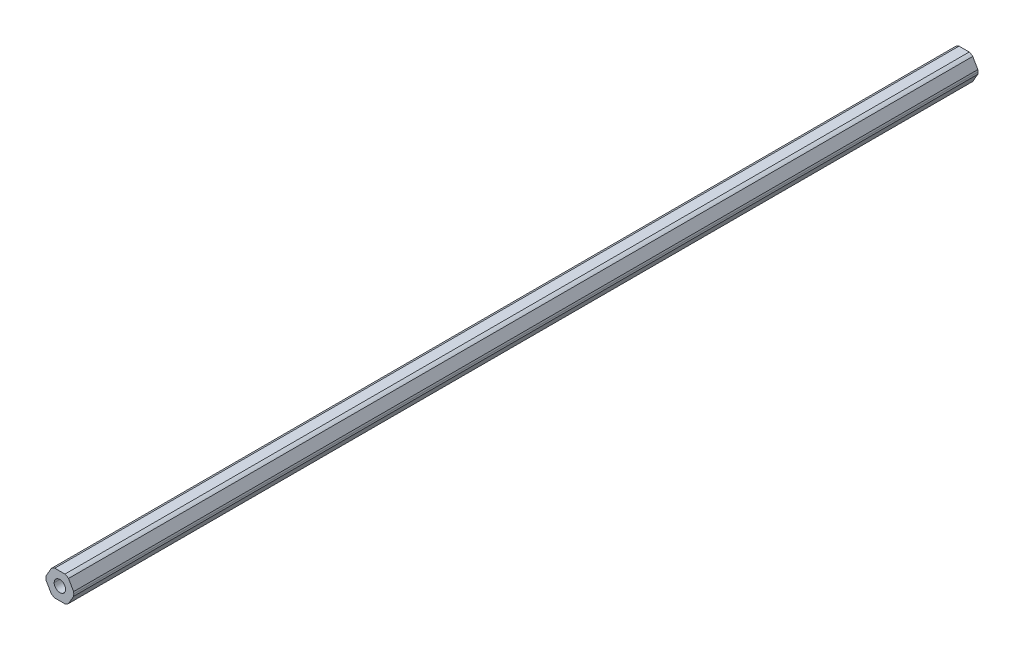
ISO-10303-21;
HEADER;
FILE_DESCRIPTION(('STEP AP214'),'2;1');
FILE_NAME('part.step','',(''),(''),'','','');
FILE_SCHEMA(('AUTOMOTIVE_DESIGN { 1 0 10303 214 1 1 1 1 }'));
ENDSEC;
DATA;
#1=APPLICATION_CONTEXT('core data for automotive mechanical design processes');
#2=APPLICATION_PROTOCOL_DEFINITION('international standard','automotive_design',2000,#1);
#3=PRODUCT_CONTEXT('',#1,'mechanical');
#4=PRODUCT('Part','Part','',(#3));
#5=PRODUCT_RELATED_PRODUCT_CATEGORY('part','',(#4));
#6=PRODUCT_DEFINITION_FORMATION('','',#4);
#7=PRODUCT_DEFINITION_CONTEXT('part definition',#1,'design');
#8=PRODUCT_DEFINITION('design','',#6,#7);
#9=PRODUCT_DEFINITION_SHAPE('','',#8);
#10=(LENGTH_UNIT() NAMED_UNIT(*) SI_UNIT(.MILLI.,.METRE.));
#11=(NAMED_UNIT(*) PLANE_ANGLE_UNIT() SI_UNIT($,.RADIAN.));
#12=(NAMED_UNIT(*) SI_UNIT($,.STERADIAN.) SOLID_ANGLE_UNIT());
#13=UNCERTAINTY_MEASURE_WITH_UNIT(LENGTH_MEASURE(1.E-05),#10,'distance_accuracy_value','');
#14=(GEOMETRIC_REPRESENTATION_CONTEXT(3) GLOBAL_UNCERTAINTY_ASSIGNED_CONTEXT((#13)) GLOBAL_UNIT_ASSIGNED_CONTEXT((#10,
#11,#12)) REPRESENTATION_CONTEXT('',''));
#15=CARTESIAN_POINT('',(0.,0.,0.));
#16=DIRECTION('',(0.,0.,1.));
#17=DIRECTION('',(1.,0.,0.));
#18=AXIS2_PLACEMENT_3D('',#15,#16,#17);
#19=CARTESIAN_POINT('',(0.,0.,-457.2));
#20=DIRECTION('',(0.,0.,1.));
#21=DIRECTION('',(1.,0.,0.));
#22=AXIS2_PLACEMENT_3D('',#19,#20,#21);
#23=CYLINDRICAL_SURFACE('',#22,2.1);
#24=CARTESIAN_POINT('',(0.,0.,-123.825));
#25=DIRECTION('',(0.,0.,1.));
#26=DIRECTION('',(1.,0.,0.));
#27=AXIS2_PLACEMENT_3D('',#24,#25,#26);
#28=CIRCLE('',#27,2.1);
#29=CARTESIAN_POINT('',(2.1,0.,-123.825));
#30=VERTEX_POINT('',#29);
#31=CARTESIAN_POINT('',(-2.1,0.,-123.825));
#32=VERTEX_POINT('',#31);
#33=EDGE_CURVE('E65',#30,#32,#28,.F.);
#34=ORIENTED_EDGE('',*,*,#33,.F.);
#35=DIRECTION('',(0.,0.,1.));
#36=VECTOR('',#35,1.);
#37=CARTESIAN_POINT('',(2.1,0.,-457.2));
#38=LINE('',#37,#36);
#39=CARTESIAN_POINT('',(2.1,0.,-457.2));
#40=VERTEX_POINT('',#39);
#41=EDGE_CURVE('E211',#40,#30,#38,.T.);
#42=ORIENTED_EDGE('',*,*,#41,.F.);
#43=CARTESIAN_POINT('',(0.,0.,-457.2));
#44=DIRECTION('',(0.,0.,1.));
#45=DIRECTION('',(1.,0.,0.));
#46=AXIS2_PLACEMENT_3D('',#43,#44,#45);
#47=CIRCLE('',#46,2.1);
#48=CARTESIAN_POINT('',(-2.1,0.,-457.2));
#49=VERTEX_POINT('',#48);
#50=EDGE_CURVE('E191',#49,#40,#47,.T.);
#51=ORIENTED_EDGE('',*,*,#50,.F.);
#52=DIRECTION('',(0.,0.,1.));
#53=VECTOR('',#52,1.);
#54=CARTESIAN_POINT('',(-2.1,0.,-457.2));
#55=LINE('',#54,#53);
#56=EDGE_CURVE('E52',#49,#32,#55,.T.);
#57=ORIENTED_EDGE('',*,*,#56,.T.);
#58=EDGE_LOOP('',(#34,#42,#51,#57));
#59=FACE_BOUND('',#58,.T.);
#60=ADVANCED_FACE('F44',(#59),#23,.F.);
#61=CARTESIAN_POINT('',(0.,0.,-457.2));
#62=DIRECTION('',(0.,0.,1.));
#63=DIRECTION('',(1.,0.,0.));
#64=AXIS2_PLACEMENT_3D('',#61,#62,#63);
#65=CYLINDRICAL_SURFACE('',#64,5.12);
#66=DIRECTION('',(0.,0.,1.));
#67=VECTOR('',#66,1.);
#68=CARTESIAN_POINT('',(5.12,0.,-457.2));
#69=LINE('',#68,#67);
#70=CARTESIAN_POINT('',(5.12,0.,-457.2));
#71=VERTEX_POINT('',#70);
#72=CARTESIAN_POINT('',(5.12,0.,-123.825));
#73=VERTEX_POINT('',#72);
#74=EDGE_CURVE('E227',#71,#73,#69,.T.);
#75=ORIENTED_EDGE('',*,*,#74,.T.);
#76=CARTESIAN_POINT('',(0.,0.,-123.825));
#77=DIRECTION('',(0.,0.,1.));
#78=DIRECTION('',(1.,0.,0.));
#79=AXIS2_PLACEMENT_3D('',#76,#77,#78);
#80=CIRCLE('',#79,5.12);
#81=CARTESIAN_POINT('',(5.06425896558911,-0.753446168913433,-123.825));
#82=VERTEX_POINT('',#81);
#83=EDGE_CURVE('E166',#82,#73,#80,.T.);
#84=ORIENTED_EDGE('',*,*,#83,.F.);
#85=DIRECTION('',(0.,0.,-1.));
#86=VECTOR('',#85,1.);
#87=CARTESIAN_POINT('',(5.06425896558911,-0.753446168913433,-457.2));
#88=LINE('',#87,#86);
#89=CARTESIAN_POINT('',(5.06425896558911,-0.753446168913433,-457.2));
#90=VERTEX_POINT('',#89);
#91=EDGE_CURVE('E230',#82,#90,#88,.T.);
#92=ORIENTED_EDGE('',*,*,#91,.T.);
#93=CARTESIAN_POINT('',(0.,0.,-457.2));
#94=DIRECTION('',(0.,0.,1.));
#95=DIRECTION('',(1.,0.,0.));
#96=AXIS2_PLACEMENT_3D('',#93,#94,#95);
#97=CIRCLE('',#96,5.12);
#98=EDGE_CURVE('E229',#90,#71,#97,.T.);
#99=ORIENTED_EDGE('',*,*,#98,.T.);
#100=EDGE_LOOP('',(#75,#84,#92,#99));
#101=FACE_BOUND('',#100,.T.);
#102=ADVANCED_FACE('F354',(#101),#65,.T.);
#103=CARTESIAN_POINT('',(2.74963065701564,-4.7625,457.2));
#104=DIRECTION('',(-0.866025403784442,0.5,0.));
#105=DIRECTION('',(0.,0.,1.));
#106=AXIS2_PLACEMENT_3D('',#103,#104,#105);
#107=PLANE('',#106);
#108=DIRECTION('',(0.499999999999991,0.866025403784444,0.));
#109=VECTOR('',#108,1.);
#110=CARTESIAN_POINT('',(3.18463300545771,-4.00905383108654,-123.825));
#111=LINE('',#110,#109);
#112=CARTESIAN_POINT('',(3.18463300545771,-4.00905383108654,-123.825));
#113=VERTEX_POINT('',#112);
#114=EDGE_CURVE('E313',#113,#82,#111,.T.);
#115=ORIENTED_EDGE('',*,*,#114,.F.);
#116=DIRECTION('',(0.,0.,1.));
#117=VECTOR('',#116,1.);
#118=CARTESIAN_POINT('',(3.1846330054577,-4.00905383108652,-457.2));
#119=LINE('',#118,#117);
#120=CARTESIAN_POINT('',(3.1846330054577,-4.00905383108652,-457.2));
#121=VERTEX_POINT('',#120);
#122=EDGE_CURVE('E185',#121,#113,#119,.T.);
#123=ORIENTED_EDGE('',*,*,#122,.F.);
#124=DIRECTION('',(0.5,0.866025403784442,0.));
#125=VECTOR('',#124,1.);
#126=CARTESIAN_POINT('',(2.74963065701564,-4.7625,-457.2));
#127=LINE('',#126,#125);
#128=EDGE_CURVE('E240',#121,#90,#127,.T.);
#129=ORIENTED_EDGE('',*,*,#128,.T.);
#130=ORIENTED_EDGE('',*,*,#91,.F.);
#131=EDGE_LOOP('',(#115,#123,#129,#130));
#132=FACE_BOUND('',#131,.T.);
#133=ADVANCED_FACE('F351',(#132),#107,.F.);
#134=CARTESIAN_POINT('',(5.49926131403117,0.,457.2));
#135=DIRECTION('',(-0.866025403784438,-0.5,0.));
#136=DIRECTION('',(-0.5,0.866025403784438,0.));
#137=AXIS2_PLACEMENT_3D('',#134,#135,#136);
#138=PLANE('',#137);
#139=DIRECTION('',(-0.500000000000001,0.866025403784438,0.));
#140=VECTOR('',#139,1.);
#141=CARTESIAN_POINT('',(5.06425896558911,0.753446168913416,-123.825));
#142=LINE('',#141,#140);
#143=CARTESIAN_POINT('',(5.06425896558911,0.753446168913416,-123.825));
#144=VERTEX_POINT('',#143);
#145=CARTESIAN_POINT('',(3.18463300545762,4.00905383108658,-123.825));
#146=VERTEX_POINT('',#145);
#147=EDGE_CURVE('E59',#144,#146,#142,.T.);
#148=ORIENTED_EDGE('',*,*,#147,.F.);
#149=DIRECTION('',(0.,0.,1.));
#150=VECTOR('',#149,1.);
#151=CARTESIAN_POINT('',(5.06425896558911,0.753446168913412,-457.2));
#152=LINE('',#151,#150);
#153=CARTESIAN_POINT('',(5.06425896558911,0.753446168913416,-457.2));
#154=VERTEX_POINT('',#153);
#155=EDGE_CURVE('E175',#154,#144,#152,.T.);
#156=ORIENTED_EDGE('',*,*,#155,.F.);
#157=DIRECTION('',(-0.5,0.866025403784438,0.));
#158=VECTOR('',#157,1.);
#159=CARTESIAN_POINT('',(5.49926131403117,0.,-457.2));
#160=LINE('',#159,#158);
#161=CARTESIAN_POINT('',(3.18463300545762,4.00905383108658,-457.2));
#162=VERTEX_POINT('',#161);
#163=EDGE_CURVE('E221',#154,#162,#160,.T.);
#164=ORIENTED_EDGE('',*,*,#163,.T.);
#165=DIRECTION('',(0.,0.,-1.));
#166=VECTOR('',#165,1.);
#167=CARTESIAN_POINT('',(3.18463300545762,4.00905383108658,-457.2));
#168=LINE('',#167,#166);
#169=EDGE_CURVE('E177',#146,#162,#168,.T.);
#170=ORIENTED_EDGE('',*,*,#169,.F.);
#171=EDGE_LOOP('',(#148,#156,#164,#170));
#172=FACE_BOUND('',#171,.T.);
#173=ADVANCED_FACE('F173',(#172),#138,.F.);
#174=CARTESIAN_POINT('',(2.74963065701557,4.7625,457.2));
#175=DIRECTION('',(0.,-1.,0.));
#176=DIRECTION('',(0.,0.,-1.));
#177=AXIS2_PLACEMENT_3D('',#174,#175,#176);
#178=PLANE('',#177);
#179=DIRECTION('',(-1.,0.,0.));
#180=VECTOR('',#179,1.);
#181=CARTESIAN_POINT('',(1.87962596013146,4.76249999999999,-123.825));
#182=LINE('',#181,#180);
#183=CARTESIAN_POINT('',(1.87962596013146,4.76249999999999,-123.825));
#184=VERTEX_POINT('',#183);
#185=CARTESIAN_POINT('',(-1.8796259601315,4.7625,-123.825));
#186=VERTEX_POINT('',#185);
#187=EDGE_CURVE('E328',#184,#186,#182,.T.);
#188=ORIENTED_EDGE('',*,*,#187,.F.);
#189=DIRECTION('',(0.,0.,1.));
#190=VECTOR('',#189,1.);
#191=CARTESIAN_POINT('',(1.87962596013147,4.7625,-457.2));
#192=LINE('',#191,#190);
#193=CARTESIAN_POINT('',(1.87962596013147,4.7625,-457.2));
#194=VERTEX_POINT('',#193);
#195=EDGE_CURVE('E202',#194,#184,#192,.T.);
#196=ORIENTED_EDGE('',*,*,#195,.F.);
#197=DIRECTION('',(-1.,0.,0.));
#198=VECTOR('',#197,1.);
#199=CARTESIAN_POINT('',(2.74963065701557,4.7625,-457.2));
#200=LINE('',#199,#198);
#201=CARTESIAN_POINT('',(-1.8796259601315,4.7625,-457.2));
#202=VERTEX_POINT('',#201);
#203=EDGE_CURVE('E255',#194,#202,#200,.T.);
#204=ORIENTED_EDGE('',*,*,#203,.T.);
#205=DIRECTION('',(0.,0.,-1.));
#206=VECTOR('',#205,1.);
#207=CARTESIAN_POINT('',(-1.8796259601315,4.7625,-457.2));
#208=LINE('',#207,#206);
#209=EDGE_CURVE('E249',#186,#202,#208,.T.);
#210=ORIENTED_EDGE('',*,*,#209,.F.);
#211=EDGE_LOOP('',(#188,#196,#204,#210));
#212=FACE_BOUND('',#211,.T.);
#213=ADVANCED_FACE('F334',(#212),#178,.F.);
#214=CARTESIAN_POINT('',(-2.7496306570156,4.7625,457.2));
#215=DIRECTION('',(0.866025403784442,-0.5,0.));
#216=DIRECTION('',(0.,0.,-1.));
#217=AXIS2_PLACEMENT_3D('',#214,#215,#216);
#218=PLANE('',#217);
#219=DIRECTION('',(-0.499999999999993,-0.866025403784443,0.));
#220=VECTOR('',#219,1.);
#221=CARTESIAN_POINT('',(-3.18463300545766,4.00905383108656,-123.825));
#222=LINE('',#221,#220);
#223=CARTESIAN_POINT('',(-3.18463300545767,4.00905383108657,-123.825));
#224=VERTEX_POINT('',#223);
#225=CARTESIAN_POINT('',(-5.06425896558912,0.753446168913382,-123.825));
#226=VERTEX_POINT('',#225);
#227=EDGE_CURVE('E324',#224,#226,#222,.T.);
#228=ORIENTED_EDGE('',*,*,#227,.F.);
#229=DIRECTION('',(0.,0.,1.));
#230=VECTOR('',#229,1.);
#231=CARTESIAN_POINT('',(-3.18463300545766,4.00905383108655,-457.2));
#232=LINE('',#231,#230);
#233=CARTESIAN_POINT('',(-3.18463300545766,4.00905383108655,-457.2));
#234=VERTEX_POINT('',#233);
#235=EDGE_CURVE('E208',#234,#224,#232,.T.);
#236=ORIENTED_EDGE('',*,*,#235,.F.);
#237=DIRECTION('',(-0.5,-0.866025403784442,0.));
#238=VECTOR('',#237,1.);
#239=CARTESIAN_POINT('',(-2.7496306570156,4.7625,-457.2));
#240=LINE('',#239,#238);
#241=CARTESIAN_POINT('',(-5.06425896558912,0.753446168913382,-457.2));
#242=VERTEX_POINT('',#241);
#243=EDGE_CURVE('E252',#234,#242,#240,.T.);
#244=ORIENTED_EDGE('',*,*,#243,.T.);
#245=DIRECTION('',(0.,0.,-1.));
#246=VECTOR('',#245,1.);
#247=CARTESIAN_POINT('',(-5.06425896558912,0.753446168913382,-457.2));
#248=LINE('',#247,#246);
#249=EDGE_CURVE('E239',#226,#242,#248,.T.);
#250=ORIENTED_EDGE('',*,*,#249,.F.);
#251=EDGE_LOOP('',(#228,#236,#244,#250));
#252=FACE_BOUND('',#251,.T.);
#253=ADVANCED_FACE('F267',(#252),#218,.F.);
#254=CARTESIAN_POINT('',(-5.49926131403117,0.,457.2));
#255=DIRECTION('',(0.866025403784435,0.500000000000007,0.));
#256=DIRECTION('',(0.,0.,-1.));
#257=AXIS2_PLACEMENT_3D('',#254,#255,#256);
#258=PLANE('',#257);
#259=DIRECTION('',(0.500000000000007,-0.866025403784435,0.));
#260=VECTOR('',#259,1.);
#261=CARTESIAN_POINT('',(-5.06425896558911,-0.753446168913448,-123.825));
#262=LINE('',#261,#260);
#263=CARTESIAN_POINT('',(-5.06425896558911,-0.753446168913446,-123.825));
#264=VERTEX_POINT('',#263);
#265=CARTESIAN_POINT('',(-3.1846330054576,-4.0090538310866,-123.825));
#266=VERTEX_POINT('',#265);
#267=EDGE_CURVE('E321',#264,#266,#262,.T.);
#268=ORIENTED_EDGE('',*,*,#267,.F.);
#269=DIRECTION('',(0.,0.,1.));
#270=VECTOR('',#269,1.);
#271=CARTESIAN_POINT('',(-5.06425896558911,-0.75344616891345,-457.2));
#272=LINE('',#271,#270);
#273=CARTESIAN_POINT('',(-5.06425896558911,-0.75344616891345,-457.2));
#274=VERTEX_POINT('',#273);
#275=EDGE_CURVE('E247',#274,#264,#272,.T.);
#276=ORIENTED_EDGE('',*,*,#275,.F.);
#277=DIRECTION('',(0.500000000000007,-0.866025403784435,0.));
#278=VECTOR('',#277,1.);
#279=CARTESIAN_POINT('',(-5.49926131403117,0.,-457.2));
#280=LINE('',#279,#278);
#281=CARTESIAN_POINT('',(-3.1846330054576,-4.0090538310866,-457.2));
#282=VERTEX_POINT('',#281);
#283=EDGE_CURVE('E256',#274,#282,#280,.T.);
#284=ORIENTED_EDGE('',*,*,#283,.T.);
#285=DIRECTION('',(0.,0.,-1.));
#286=VECTOR('',#285,1.);
#287=CARTESIAN_POINT('',(-3.1846330054576,-4.0090538310866,-457.2));
#288=LINE('',#287,#286);
#289=EDGE_CURVE('E223',#266,#282,#288,.T.);
#290=ORIENTED_EDGE('',*,*,#289,.F.);
#291=EDGE_LOOP('',(#268,#276,#284,#290));
#292=FACE_BOUND('',#291,.T.);
#293=ADVANCED_FACE('F340',(#292),#258,.F.);
#294=CARTESIAN_POINT('',(-2.74963065701554,-4.7625,457.2));
#295=DIRECTION('',(0.,1.,0.));
#296=DIRECTION('',(1.,0.,0.));
#297=AXIS2_PLACEMENT_3D('',#294,#295,#296);
#298=PLANE('',#297);
#299=DIRECTION('',(1.,0.,0.));
#300=VECTOR('',#299,1.);
#301=CARTESIAN_POINT('',(-1.87962596013144,-4.7625,-123.825));
#302=LINE('',#301,#300);
#303=CARTESIAN_POINT('',(-1.87962596013144,-4.7625,-123.825));
#304=VERTEX_POINT('',#303);
#305=CARTESIAN_POINT('',(1.87962596013154,-4.7625,-123.825));
#306=VERTEX_POINT('',#305);
#307=EDGE_CURVE('E317',#304,#306,#302,.T.);
#308=ORIENTED_EDGE('',*,*,#307,.F.);
#309=DIRECTION('',(0.,0.,1.));
#310=VECTOR('',#309,1.);
#311=CARTESIAN_POINT('',(-1.87962596013144,-4.7625,-457.2));
#312=LINE('',#311,#310);
#313=CARTESIAN_POINT('',(-1.87962596013144,-4.7625,-457.2));
#314=VERTEX_POINT('',#313);
#315=EDGE_CURVE('E235',#314,#304,#312,.T.);
#316=ORIENTED_EDGE('',*,*,#315,.F.);
#317=DIRECTION('',(1.,0.,0.));
#318=VECTOR('',#317,1.);
#319=CARTESIAN_POINT('',(-2.74963065701554,-4.7625,-457.2));
#320=LINE('',#319,#318);
#321=CARTESIAN_POINT('',(1.87962596013154,-4.7625,-457.2));
#322=VERTEX_POINT('',#321);
#323=EDGE_CURVE('E280',#314,#322,#320,.T.);
#324=ORIENTED_EDGE('',*,*,#323,.T.);
#325=DIRECTION('',(0.,0.,-1.));
#326=VECTOR('',#325,1.);
#327=CARTESIAN_POINT('',(1.87962596013154,-4.7625,-457.2));
#328=LINE('',#327,#326);
#329=EDGE_CURVE('E195',#306,#322,#328,.T.);
#330=ORIENTED_EDGE('',*,*,#329,.F.);
#331=EDGE_LOOP('',(#308,#316,#324,#330));
#332=FACE_BOUND('',#331,.T.);
#333=ADVANCED_FACE('F345',(#332),#298,.F.);
#334=CARTESIAN_POINT('',(0.,0.,-457.2));
#335=DIRECTION('',(0.,0.,1.));
#336=DIRECTION('',(1.,0.,0.));
#337=AXIS2_PLACEMENT_3D('',#334,#335,#336);
#338=CYLINDRICAL_SURFACE('',#337,5.12);
#339=ORIENTED_EDGE('',*,*,#155,.T.);
#340=EDGE_CURVE('E163',#73,#144,#80,.T.);
#341=ORIENTED_EDGE('',*,*,#340,.F.);
#342=ORIENTED_EDGE('',*,*,#74,.F.);
#343=CARTESIAN_POINT('',(0.,0.,-457.2));
#344=DIRECTION('',(0.,0.,1.));
#345=DIRECTION('',(1.,0.,0.));
#346=AXIS2_PLACEMENT_3D('',#343,#344,#345);
#347=CIRCLE('',#346,5.12);
#348=EDGE_CURVE('E183',#71,#154,#347,.T.);
#349=ORIENTED_EDGE('',*,*,#348,.T.);
#350=EDGE_LOOP('',(#339,#341,#342,#349));
#351=FACE_BOUND('',#350,.T.);
#352=ADVANCED_FACE('F181',(#351),#338,.T.);
#353=CARTESIAN_POINT('',(0.,0.,-457.2));
#354=DIRECTION('',(0.,0.,1.));
#355=DIRECTION('',(1.,0.,0.));
#356=AXIS2_PLACEMENT_3D('',#353,#354,#355);
#357=CYLINDRICAL_SURFACE('',#356,5.12);
#358=ORIENTED_EDGE('',*,*,#122,.T.);
#359=CARTESIAN_POINT('',(0.,0.,-123.825));
#360=DIRECTION('',(0.,0.,1.));
#361=DIRECTION('',(1.,0.,0.));
#362=AXIS2_PLACEMENT_3D('',#359,#360,#361);
#363=CIRCLE('',#362,5.12000000000003);
#364=EDGE_CURVE('E315',#306,#113,#363,.T.);
#365=ORIENTED_EDGE('',*,*,#364,.F.);
#366=ORIENTED_EDGE('',*,*,#329,.T.);
#367=CARTESIAN_POINT('',(0.,0.,-457.2));
#368=DIRECTION('',(0.,0.,1.));
#369=DIRECTION('',(1.,0.,0.));
#370=AXIS2_PLACEMENT_3D('',#367,#368,#369);
#371=CIRCLE('',#370,5.12);
#372=EDGE_CURVE('E225',#322,#121,#371,.T.);
#373=ORIENTED_EDGE('',*,*,#372,.T.);
#374=EDGE_LOOP('',(#358,#365,#366,#373));
#375=FACE_BOUND('',#374,.T.);
#376=ADVANCED_FACE('F352',(#375),#357,.T.);
#377=CARTESIAN_POINT('',(0.,0.,-457.2));
#378=DIRECTION('',(0.,0.,1.));
#379=DIRECTION('',(1.,0.,0.));
#380=AXIS2_PLACEMENT_3D('',#377,#378,#379);
#381=CYLINDRICAL_SURFACE('',#380,5.12);
#382=ORIENTED_EDGE('',*,*,#315,.T.);
#383=CARTESIAN_POINT('',(0.,0.,-123.825));
#384=DIRECTION('',(0.,0.,1.));
#385=DIRECTION('',(1.,0.,0.));
#386=AXIS2_PLACEMENT_3D('',#383,#384,#385);
#387=CIRCLE('',#386,5.12);
#388=EDGE_CURVE('E319',#266,#304,#387,.T.);
#389=ORIENTED_EDGE('',*,*,#388,.F.);
#390=ORIENTED_EDGE('',*,*,#289,.T.);
#391=CARTESIAN_POINT('',(0.,0.,-457.2));
#392=DIRECTION('',(0.,0.,1.));
#393=DIRECTION('',(1.,0.,0.));
#394=AXIS2_PLACEMENT_3D('',#391,#392,#393);
#395=CIRCLE('',#394,5.12);
#396=EDGE_CURVE('E226',#282,#314,#395,.T.);
#397=ORIENTED_EDGE('',*,*,#396,.T.);
#398=EDGE_LOOP('',(#382,#389,#390,#397));
#399=FACE_BOUND('',#398,.T.);
#400=ADVANCED_FACE('F342',(#399),#381,.T.);
#401=CARTESIAN_POINT('',(0.,0.,-457.2));
#402=DIRECTION('',(0.,0.,1.));
#403=DIRECTION('',(1.,0.,0.));
#404=AXIS2_PLACEMENT_3D('',#401,#402,#403);
#405=CYLINDRICAL_SURFACE('',#404,5.12);
#406=ORIENTED_EDGE('',*,*,#275,.T.);
#407=CARTESIAN_POINT('',(0.,0.,-123.825));
#408=DIRECTION('',(0.,0.,1.));
#409=DIRECTION('',(1.,0.,0.));
#410=AXIS2_PLACEMENT_3D('',#407,#408,#409);
#411=CIRCLE('',#410,5.12);
#412=EDGE_CURVE('E263',#226,#264,#411,.T.);
#413=ORIENTED_EDGE('',*,*,#412,.F.);
#414=ORIENTED_EDGE('',*,*,#249,.T.);
#415=CARTESIAN_POINT('',(0.,0.,-457.2));
#416=DIRECTION('',(0.,0.,1.));
#417=DIRECTION('',(1.,0.,0.));
#418=AXIS2_PLACEMENT_3D('',#415,#416,#417);
#419=CIRCLE('',#418,5.12);
#420=EDGE_CURVE('E244',#242,#274,#419,.T.);
#421=ORIENTED_EDGE('',*,*,#420,.T.);
#422=EDGE_LOOP('',(#406,#413,#414,#421));
#423=FACE_BOUND('',#422,.T.);
#424=ADVANCED_FACE('F261',(#423),#405,.T.);
#425=CARTESIAN_POINT('',(0.,0.,-457.2));
#426=DIRECTION('',(0.,0.,1.));
#427=DIRECTION('',(1.,0.,0.));
#428=AXIS2_PLACEMENT_3D('',#425,#426,#427);
#429=CYLINDRICAL_SURFACE('',#428,5.12);
#430=ORIENTED_EDGE('',*,*,#235,.T.);
#431=CARTESIAN_POINT('',(0.,0.,-123.825));
#432=DIRECTION('',(0.,0.,1.));
#433=DIRECTION('',(1.,0.,0.));
#434=AXIS2_PLACEMENT_3D('',#431,#432,#433);
#435=CIRCLE('',#434,5.12000000000002);
#436=EDGE_CURVE('E326',#186,#224,#435,.T.);
#437=ORIENTED_EDGE('',*,*,#436,.F.);
#438=ORIENTED_EDGE('',*,*,#209,.T.);
#439=CARTESIAN_POINT('',(0.,0.,-457.2));
#440=DIRECTION('',(0.,0.,1.));
#441=DIRECTION('',(1.,0.,0.));
#442=AXIS2_PLACEMENT_3D('',#439,#440,#441);
#443=CIRCLE('',#442,5.12);
#444=EDGE_CURVE('E234',#202,#234,#443,.T.);
#445=ORIENTED_EDGE('',*,*,#444,.T.);
#446=EDGE_LOOP('',(#430,#437,#438,#445));
#447=FACE_BOUND('',#446,.T.);
#448=ADVANCED_FACE('F337',(#447),#429,.T.);
#449=CARTESIAN_POINT('',(0.,0.,-457.2));
#450=DIRECTION('',(0.,0.,1.));
#451=DIRECTION('',(1.,0.,0.));
#452=AXIS2_PLACEMENT_3D('',#449,#450,#451);
#453=CYLINDRICAL_SURFACE('',#452,5.12);
#454=ORIENTED_EDGE('',*,*,#195,.T.);
#455=CARTESIAN_POINT('',(0.,0.,-123.825));
#456=DIRECTION('',(0.,0.,1.));
#457=DIRECTION('',(1.,0.,0.));
#458=AXIS2_PLACEMENT_3D('',#455,#456,#457);
#459=CIRCLE('',#458,5.12);
#460=EDGE_CURVE('E178',#146,#184,#459,.T.);
#461=ORIENTED_EDGE('',*,*,#460,.F.);
#462=ORIENTED_EDGE('',*,*,#169,.T.);
#463=CARTESIAN_POINT('',(0.,0.,-457.2));
#464=DIRECTION('',(0.,0.,1.));
#465=DIRECTION('',(1.,0.,0.));
#466=AXIS2_PLACEMENT_3D('',#463,#464,#465);
#467=CIRCLE('',#466,5.12);
#468=EDGE_CURVE('E200',#162,#194,#467,.T.);
#469=ORIENTED_EDGE('',*,*,#468,.T.);
#470=EDGE_LOOP('',(#454,#461,#462,#469));
#471=FACE_BOUND('',#470,.T.);
#472=ADVANCED_FACE('F369',(#471),#453,.T.);
#473=CARTESIAN_POINT('',(0.,0.,-457.2));
#474=DIRECTION('',(0.,0.,1.));
#475=DIRECTION('',(1.,0.,0.));
#476=AXIS2_PLACEMENT_3D('',#473,#474,#475);
#477=CYLINDRICAL_SURFACE('',#476,2.1);
#478=CARTESIAN_POINT('',(0.,0.,-123.825));
#479=DIRECTION('',(0.,0.,1.));
#480=DIRECTION('',(1.,0.,0.));
#481=AXIS2_PLACEMENT_3D('',#478,#479,#480);
#482=CIRCLE('',#481,2.1);
#483=EDGE_CURVE('E11',#32,#30,#482,.F.);
#484=ORIENTED_EDGE('',*,*,#483,.F.);
#485=ORIENTED_EDGE('',*,*,#56,.F.);
#486=CARTESIAN_POINT('',(0.,0.,-457.2));
#487=DIRECTION('',(0.,0.,1.));
#488=DIRECTION('',(1.,0.,0.));
#489=AXIS2_PLACEMENT_3D('',#486,#487,#488);
#490=CIRCLE('',#489,2.1);
#491=EDGE_CURVE('E198',#40,#49,#490,.T.);
#492=ORIENTED_EDGE('',*,*,#491,.F.);
#493=ORIENTED_EDGE('',*,*,#41,.T.);
#494=EDGE_LOOP('',(#484,#485,#492,#493));
#495=FACE_BOUND('',#494,.T.);
#496=ADVANCED_FACE('F385',(#495),#477,.F.);
#497=CARTESIAN_POINT('',(0.,0.,-457.2));
#498=DIRECTION('',(0.,0.,1.));
#499=DIRECTION('',(1.,0.,0.));
#500=AXIS2_PLACEMENT_3D('',#497,#498,#499);
#501=PLANE('',#500);
#502=ORIENTED_EDGE('',*,*,#468,.F.);
#503=ORIENTED_EDGE('',*,*,#163,.F.);
#504=ORIENTED_EDGE('',*,*,#348,.F.);
#505=ORIENTED_EDGE('',*,*,#98,.F.);
#506=ORIENTED_EDGE('',*,*,#128,.F.);
#507=ORIENTED_EDGE('',*,*,#372,.F.);
#508=ORIENTED_EDGE('',*,*,#323,.F.);
#509=ORIENTED_EDGE('',*,*,#396,.F.);
#510=ORIENTED_EDGE('',*,*,#283,.F.);
#511=ORIENTED_EDGE('',*,*,#420,.F.);
#512=ORIENTED_EDGE('',*,*,#243,.F.);
#513=ORIENTED_EDGE('',*,*,#444,.F.);
#514=ORIENTED_EDGE('',*,*,#203,.F.);
#515=EDGE_LOOP('',(#502,#503,#504,#505,#506,#507,#508,#509,#510,#511,#512,#513,#514));
#516=FACE_BOUND('',#515,.T.);
#517=ORIENTED_EDGE('',*,*,#491,.T.);
#518=ORIENTED_EDGE('',*,*,#50,.T.);
#519=EDGE_LOOP('',(#517,#518));
#520=FACE_BOUND('',#519,.T.);
#521=ADVANCED_FACE('F46',(#516,#520),#501,.F.);
#522=CARTESIAN_POINT('',(0.,0.,-123.825));
#523=DIRECTION('',(0.,0.,1.));
#524=DIRECTION('',(1.,0.,0.));
#525=AXIS2_PLACEMENT_3D('',#522,#523,#524);
#526=PLANE('',#525);
#527=ORIENTED_EDGE('',*,*,#83,.T.);
#528=ORIENTED_EDGE('',*,*,#340,.T.);
#529=ORIENTED_EDGE('',*,*,#147,.T.);
#530=ORIENTED_EDGE('',*,*,#460,.T.);
#531=ORIENTED_EDGE('',*,*,#187,.T.);
#532=ORIENTED_EDGE('',*,*,#436,.T.);
#533=ORIENTED_EDGE('',*,*,#227,.T.);
#534=ORIENTED_EDGE('',*,*,#412,.T.);
#535=ORIENTED_EDGE('',*,*,#267,.T.);
#536=ORIENTED_EDGE('',*,*,#388,.T.);
#537=ORIENTED_EDGE('',*,*,#307,.T.);
#538=ORIENTED_EDGE('',*,*,#364,.T.);
#539=ORIENTED_EDGE('',*,*,#114,.T.);
#540=EDGE_LOOP('',(#527,#528,#529,#530,#531,#532,#533,#534,#535,#536,#537,#538,#539));
#541=FACE_BOUND('',#540,.T.);
#542=ORIENTED_EDGE('',*,*,#33,.T.);
#543=ORIENTED_EDGE('',*,*,#483,.T.);
#544=EDGE_LOOP('',(#542,#543));
#545=FACE_BOUND('',#544,.T.);
#546=ADVANCED_FACE('F164',(#541,#545),#526,.T.);
#547=CLOSED_SHELL('',(#60,#102,#133,#173,#213,#253,#293,#333,#352,#376,#400,#424,#448,#472,#496,
#521,#546));
#548=MANIFOLD_SOLID_BREP('B2',#547);
#549=ADVANCED_BREP_SHAPE_REPRESENTATION('',(#18,#548),#14);
#550=SHAPE_DEFINITION_REPRESENTATION(#9,#549);
ENDSEC;
END-ISO-10303-21;
